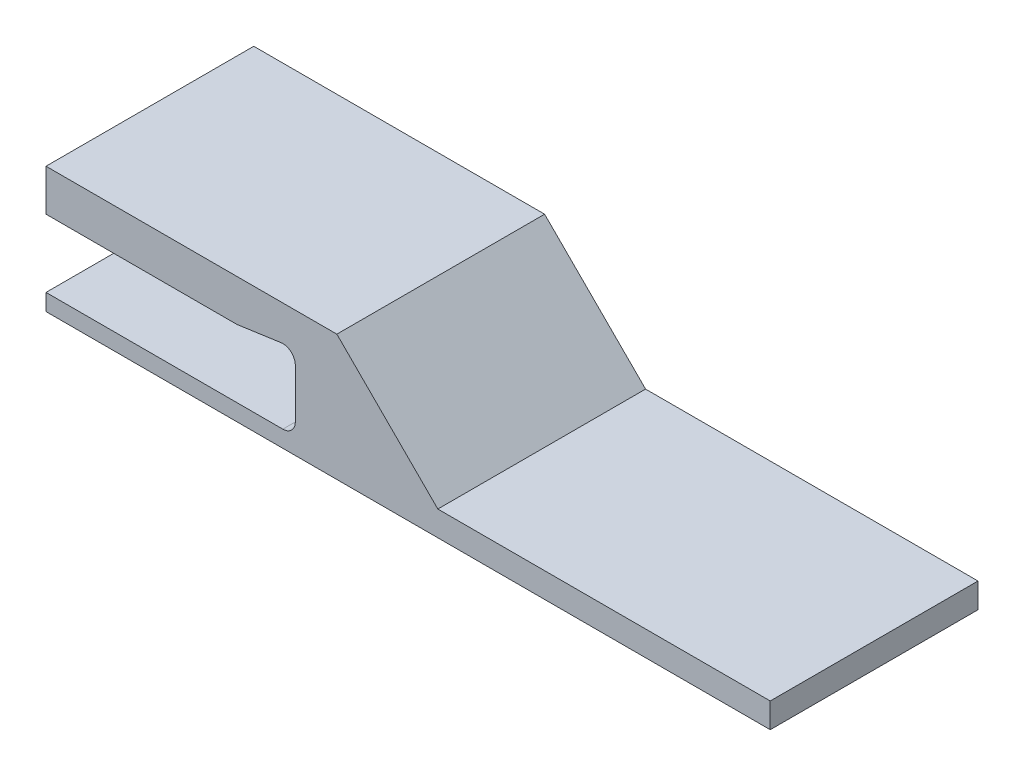
ISO-10303-21;
HEADER;
FILE_DESCRIPTION(('STEP AP214'),'2;1');
FILE_NAME('part.step','',(''),(''),'','','');
FILE_SCHEMA(('AUTOMOTIVE_DESIGN { 1 0 10303 214 1 1 1 1 }'));
ENDSEC;
DATA;
#1=APPLICATION_CONTEXT('core data for automotive mechanical design processes');
#2=APPLICATION_PROTOCOL_DEFINITION('international standard','automotive_design',2000,#1);
#3=PRODUCT_CONTEXT('',#1,'mechanical');
#4=PRODUCT('Part','Part','',(#3));
#5=PRODUCT_RELATED_PRODUCT_CATEGORY('part','',(#4));
#6=PRODUCT_DEFINITION_FORMATION('','',#4);
#7=PRODUCT_DEFINITION_CONTEXT('part definition',#1,'design');
#8=PRODUCT_DEFINITION('design','',#6,#7);
#9=PRODUCT_DEFINITION_SHAPE('','',#8);
#10=(LENGTH_UNIT() NAMED_UNIT(*) SI_UNIT(.MILLI.,.METRE.));
#11=(NAMED_UNIT(*) PLANE_ANGLE_UNIT() SI_UNIT($,.RADIAN.));
#12=(NAMED_UNIT(*) SI_UNIT($,.STERADIAN.) SOLID_ANGLE_UNIT());
#13=UNCERTAINTY_MEASURE_WITH_UNIT(LENGTH_MEASURE(1.E-05),#10,'distance_accuracy_value','');
#14=(GEOMETRIC_REPRESENTATION_CONTEXT(3) GLOBAL_UNCERTAINTY_ASSIGNED_CONTEXT((#13)) GLOBAL_UNIT_ASSIGNED_CONTEXT((#10,
#11,#12)) REPRESENTATION_CONTEXT('',''));
#15=CARTESIAN_POINT('',(0.,0.,0.));
#16=DIRECTION('',(0.,0.,1.));
#17=DIRECTION('',(1.,0.,0.));
#18=AXIS2_PLACEMENT_3D('',#15,#16,#17);
#19=CARTESIAN_POINT('',(174.3,0.,50.));
#20=DIRECTION('',(0.,1.,0.));
#21=DIRECTION('',(0.,0.,1.));
#22=AXIS2_PLACEMENT_3D('',#19,#20,#21);
#23=PLANE('',#22);
#24=DIRECTION('',(1.,0.,0.));
#25=VECTOR('',#24,1.);
#26=CARTESIAN_POINT('',(174.3,0.,0.));
#27=LINE('',#26,#25);
#28=CARTESIAN_POINT('',(0.,0.,0.));
#29=VERTEX_POINT('',#28);
#30=CARTESIAN_POINT('',(174.3,0.,0.));
#31=VERTEX_POINT('',#30);
#32=EDGE_CURVE('E171',#29,#31,#27,.T.);
#33=ORIENTED_EDGE('',*,*,#32,.T.);
#34=DIRECTION('',(0.,0.,-1.));
#35=VECTOR('',#34,1.);
#36=CARTESIAN_POINT('',(174.3,0.,50.));
#37=LINE('',#36,#35);
#38=CARTESIAN_POINT('',(174.3,0.,50.));
#39=VERTEX_POINT('',#38);
#40=EDGE_CURVE('E11',#39,#31,#37,.T.);
#41=ORIENTED_EDGE('',*,*,#40,.F.);
#42=DIRECTION('',(1.,0.,0.));
#43=VECTOR('',#42,1.);
#44=CARTESIAN_POINT('',(174.3,0.,50.));
#45=LINE('',#44,#43);
#46=CARTESIAN_POINT('',(0.,0.,50.));
#47=VERTEX_POINT('',#46);
#48=EDGE_CURVE('E197',#47,#39,#45,.T.);
#49=ORIENTED_EDGE('',*,*,#48,.F.);
#50=DIRECTION('',(0.,0.,-1.));
#51=VECTOR('',#50,1.);
#52=CARTESIAN_POINT('',(0.,0.,50.));
#53=LINE('',#52,#51);
#54=EDGE_CURVE('E167',#47,#29,#53,.T.);
#55=ORIENTED_EDGE('',*,*,#54,.T.);
#56=EDGE_LOOP('',(#33,#41,#49,#55));
#57=FACE_BOUND('',#56,.T.);
#58=ADVANCED_FACE('F39',(#57),#23,.F.);
#59=CARTESIAN_POINT('',(174.3,5.99999999999999,50.));
#60=DIRECTION('',(-1.,0.,0.));
#61=DIRECTION('',(0.,0.,1.));
#62=AXIS2_PLACEMENT_3D('',#59,#60,#61);
#63=PLANE('',#62);
#64=DIRECTION('',(0.,1.,0.));
#65=VECTOR('',#64,1.);
#66=CARTESIAN_POINT('',(174.3,5.99999999999999,0.));
#67=LINE('',#66,#65);
#68=CARTESIAN_POINT('',(174.3,5.99999999999999,0.));
#69=VERTEX_POINT('',#68);
#70=EDGE_CURVE('E174',#31,#69,#67,.T.);
#71=ORIENTED_EDGE('',*,*,#70,.T.);
#72=DIRECTION('',(0.,0.,-1.));
#73=VECTOR('',#72,1.);
#74=CARTESIAN_POINT('',(174.3,5.99999999999999,50.));
#75=LINE('',#74,#73);
#76=CARTESIAN_POINT('',(174.3,5.99999999999999,50.));
#77=VERTEX_POINT('',#76);
#78=EDGE_CURVE('E47',#77,#69,#75,.T.);
#79=ORIENTED_EDGE('',*,*,#78,.F.);
#80=DIRECTION('',(0.,1.,0.));
#81=VECTOR('',#80,1.);
#82=CARTESIAN_POINT('',(174.3,5.99999999999999,50.));
#83=LINE('',#82,#81);
#84=EDGE_CURVE('E116',#39,#77,#83,.T.);
#85=ORIENTED_EDGE('',*,*,#84,.F.);
#86=ORIENTED_EDGE('',*,*,#40,.T.);
#87=EDGE_LOOP('',(#71,#79,#85,#86));
#88=FACE_BOUND('',#87,.T.);
#89=ADVANCED_FACE('F285',(#88),#63,.F.);
#90=CARTESIAN_POINT('',(94.2999999999999,5.99999999999999,50.));
#91=DIRECTION('',(0.,-1.,0.));
#92=DIRECTION('',(1.,0.,0.));
#93=AXIS2_PLACEMENT_3D('',#90,#91,#92);
#94=PLANE('',#93);
#95=DIRECTION('',(-1.,0.,0.));
#96=VECTOR('',#95,1.);
#97=CARTESIAN_POINT('',(94.2999999999999,5.99999999999999,0.));
#98=LINE('',#97,#96);
#99=CARTESIAN_POINT('',(94.2999999999999,5.99999999999999,0.));
#100=VERTEX_POINT('',#99);
#101=EDGE_CURVE('E176',#69,#100,#98,.T.);
#102=ORIENTED_EDGE('',*,*,#101,.T.);
#103=DIRECTION('',(0.,0.,-1.));
#104=VECTOR('',#103,1.);
#105=CARTESIAN_POINT('',(94.2999999999999,5.99999999999999,50.));
#106=LINE('',#105,#104);
#107=CARTESIAN_POINT('',(94.2999999999999,5.99999999999999,50.));
#108=VERTEX_POINT('',#107);
#109=EDGE_CURVE('E222',#108,#100,#106,.T.);
#110=ORIENTED_EDGE('',*,*,#109,.F.);
#111=DIRECTION('',(-1.,0.,0.));
#112=VECTOR('',#111,1.);
#113=CARTESIAN_POINT('',(94.2999999999999,5.99999999999999,50.));
#114=LINE('',#113,#112);
#115=EDGE_CURVE('E230',#77,#108,#114,.T.);
#116=ORIENTED_EDGE('',*,*,#115,.F.);
#117=ORIENTED_EDGE('',*,*,#78,.T.);
#118=EDGE_LOOP('',(#102,#110,#116,#117));
#119=FACE_BOUND('',#118,.T.);
#120=ADVANCED_FACE('F228',(#119),#94,.F.);
#121=CARTESIAN_POINT('',(70.,30.3,50.));
#122=DIRECTION('',(-0.707106781186549,-0.707106781186546,0.));
#123=DIRECTION('',(0.707106781186546,-0.707106781186549,0.));
#124=AXIS2_PLACEMENT_3D('',#121,#122,#123);
#125=PLANE('',#124);
#126=DIRECTION('',(-0.707106781186546,0.707106781186549,0.));
#127=VECTOR('',#126,1.);
#128=CARTESIAN_POINT('',(70.,30.3,0.));
#129=LINE('',#128,#127);
#130=CARTESIAN_POINT('',(70.,30.3,0.));
#131=VERTEX_POINT('',#130);
#132=EDGE_CURVE('E178',#100,#131,#129,.T.);
#133=ORIENTED_EDGE('',*,*,#132,.T.);
#134=DIRECTION('',(0.,0.,-1.));
#135=VECTOR('',#134,1.);
#136=CARTESIAN_POINT('',(70.,30.3,50.));
#137=LINE('',#136,#135);
#138=CARTESIAN_POINT('',(70.,30.3,50.));
#139=VERTEX_POINT('',#138);
#140=EDGE_CURVE('E219',#139,#131,#137,.T.);
#141=ORIENTED_EDGE('',*,*,#140,.F.);
#142=DIRECTION('',(-0.707106781186546,0.707106781186549,0.));
#143=VECTOR('',#142,1.);
#144=CARTESIAN_POINT('',(70.,30.3,50.));
#145=LINE('',#144,#143);
#146=EDGE_CURVE('E248',#108,#139,#145,.T.);
#147=ORIENTED_EDGE('',*,*,#146,.F.);
#148=ORIENTED_EDGE('',*,*,#109,.T.);
#149=EDGE_LOOP('',(#133,#141,#147,#148));
#150=FACE_BOUND('',#149,.T.);
#151=ADVANCED_FACE('F239',(#150),#125,.F.);
#152=CARTESIAN_POINT('',(0.,30.3,50.));
#153=DIRECTION('',(0.,-1.,0.));
#154=DIRECTION('',(0.,0.,-1.));
#155=AXIS2_PLACEMENT_3D('',#152,#153,#154);
#156=PLANE('',#155);
#157=DIRECTION('',(-1.,0.,0.));
#158=VECTOR('',#157,1.);
#159=CARTESIAN_POINT('',(0.,30.3,0.));
#160=LINE('',#159,#158);
#161=CARTESIAN_POINT('',(0.,30.3,0.));
#162=VERTEX_POINT('',#161);
#163=EDGE_CURVE('E180',#131,#162,#160,.T.);
#164=ORIENTED_EDGE('',*,*,#163,.T.);
#165=DIRECTION('',(0.,0.,-1.));
#166=VECTOR('',#165,1.);
#167=CARTESIAN_POINT('',(0.,30.3,50.));
#168=LINE('',#167,#166);
#169=CARTESIAN_POINT('',(0.,30.3,50.));
#170=VERTEX_POINT('',#169);
#171=EDGE_CURVE('E216',#170,#162,#168,.T.);
#172=ORIENTED_EDGE('',*,*,#171,.F.);
#173=DIRECTION('',(-1.,0.,0.));
#174=VECTOR('',#173,1.);
#175=CARTESIAN_POINT('',(0.,30.3,50.));
#176=LINE('',#175,#174);
#177=EDGE_CURVE('E245',#139,#170,#176,.T.);
#178=ORIENTED_EDGE('',*,*,#177,.F.);
#179=ORIENTED_EDGE('',*,*,#140,.T.);
#180=EDGE_LOOP('',(#164,#172,#178,#179));
#181=FACE_BOUND('',#180,.T.);
#182=ADVANCED_FACE('F243',(#181),#156,.F.);
#183=CARTESIAN_POINT('',(0.,20.3,50.));
#184=DIRECTION('',(1.,0.,0.));
#185=DIRECTION('',(0.,0.,-1.));
#186=AXIS2_PLACEMENT_3D('',#183,#184,#185);
#187=PLANE('',#186);
#188=DIRECTION('',(0.,-1.,0.));
#189=VECTOR('',#188,1.);
#190=CARTESIAN_POINT('',(0.,20.3,0.));
#191=LINE('',#190,#189);
#192=CARTESIAN_POINT('',(0.,20.3,0.));
#193=VERTEX_POINT('',#192);
#194=EDGE_CURVE('E182',#162,#193,#191,.T.);
#195=ORIENTED_EDGE('',*,*,#194,.T.);
#196=DIRECTION('',(0.,0.,-1.));
#197=VECTOR('',#196,1.);
#198=CARTESIAN_POINT('',(0.,20.3,50.));
#199=LINE('',#198,#197);
#200=CARTESIAN_POINT('',(0.,20.3,50.));
#201=VERTEX_POINT('',#200);
#202=EDGE_CURVE('E213',#201,#193,#199,.T.);
#203=ORIENTED_EDGE('',*,*,#202,.F.);
#204=DIRECTION('',(0.,-1.,0.));
#205=VECTOR('',#204,1.);
#206=CARTESIAN_POINT('',(0.,20.3,50.));
#207=LINE('',#206,#205);
#208=EDGE_CURVE('E247',#170,#201,#207,.T.);
#209=ORIENTED_EDGE('',*,*,#208,.F.);
#210=ORIENTED_EDGE('',*,*,#171,.T.);
#211=EDGE_LOOP('',(#195,#203,#209,#210));
#212=FACE_BOUND('',#211,.T.);
#213=ADVANCED_FACE('F298',(#212),#187,.F.);
#214=CARTESIAN_POINT('',(45.7867965644036,20.3,50.));
#215=DIRECTION('',(0.,1.,0.));
#216=DIRECTION('',(-1.,0.,0.));
#217=AXIS2_PLACEMENT_3D('',#214,#215,#216);
#218=PLANE('',#217);
#219=DIRECTION('',(1.,0.,0.));
#220=VECTOR('',#219,1.);
#221=CARTESIAN_POINT('',(45.7867965644036,20.3,0.));
#222=LINE('',#221,#220);
#223=CARTESIAN_POINT('',(45.7867965644036,20.3,0.));
#224=VERTEX_POINT('',#223);
#225=EDGE_CURVE('E184',#193,#224,#222,.T.);
#226=ORIENTED_EDGE('',*,*,#225,.T.);
#227=DIRECTION('',(0.,0.,-1.));
#228=VECTOR('',#227,1.);
#229=CARTESIAN_POINT('',(45.7867965644036,20.3,50.));
#230=LINE('',#229,#228);
#231=CARTESIAN_POINT('',(45.7867965644036,20.3,50.));
#232=VERTEX_POINT('',#231);
#233=EDGE_CURVE('E210',#232,#224,#230,.T.);
#234=ORIENTED_EDGE('',*,*,#233,.F.);
#235=DIRECTION('',(1.,0.,0.));
#236=VECTOR('',#235,1.);
#237=CARTESIAN_POINT('',(45.7867965644036,20.3,50.));
#238=LINE('',#237,#236);
#239=EDGE_CURVE('E250',#201,#232,#238,.T.);
#240=ORIENTED_EDGE('',*,*,#239,.F.);
#241=ORIENTED_EDGE('',*,*,#202,.T.);
#242=EDGE_LOOP('',(#226,#234,#240,#241));
#243=FACE_BOUND('',#242,.T.);
#244=ADVANCED_FACE('F301',(#243),#218,.F.);
#245=CARTESIAN_POINT('',(45.7867965644036,23.3,50.));
#246=DIRECTION('',(0.,0.,-1.));
#247=DIRECTION('',(-1.,0.,0.));
#248=AXIS2_PLACEMENT_3D('',#245,#246,#247);
#249=CYLINDRICAL_SURFACE('',#248,3.);
#250=CARTESIAN_POINT('',(45.7867965644036,23.3,0.));
#251=DIRECTION('',(0.,0.,1.));
#252=DIRECTION('',(-1.,0.,0.));
#253=AXIS2_PLACEMENT_3D('',#250,#251,#252);
#254=CIRCLE('',#253,3.);
#255=CARTESIAN_POINT('',(46.2110606331155,20.3301515190165,0.));
#256=VERTEX_POINT('',#255);
#257=EDGE_CURVE('E186',#224,#256,#254,.T.);
#258=ORIENTED_EDGE('',*,*,#257,.T.);
#259=DIRECTION('',(0.,0.,-1.));
#260=VECTOR('',#259,1.);
#261=CARTESIAN_POINT('',(46.2110606331155,20.3301515190165,50.));
#262=LINE('',#261,#260);
#263=CARTESIAN_POINT('',(46.2110606331155,20.3301515190165,50.));
#264=VERTEX_POINT('',#263);
#265=EDGE_CURVE('E207',#264,#256,#262,.T.);
#266=ORIENTED_EDGE('',*,*,#265,.F.);
#267=CARTESIAN_POINT('',(45.7867965644036,23.3,50.));
#268=DIRECTION('',(0.,0.,1.));
#269=DIRECTION('',(-1.,0.,0.));
#270=AXIS2_PLACEMENT_3D('',#267,#268,#269);
#271=CIRCLE('',#270,3.);
#272=EDGE_CURVE('E256',#232,#264,#271,.T.);
#273=ORIENTED_EDGE('',*,*,#272,.F.);
#274=ORIENTED_EDGE('',*,*,#233,.T.);
#275=EDGE_LOOP('',(#258,#266,#273,#274));
#276=FACE_BOUND('',#275,.T.);
#277=ADVANCED_FACE('F305',(#276),#249,.T.);
#278=CARTESIAN_POINT('',(56.5757359312881,21.8108194187554,50.));
#279=DIRECTION('',(-0.141421356237309,0.989949493661167,0.));
#280=DIRECTION('',(-0.989949493661167,-0.141421356237309,0.));
#281=AXIS2_PLACEMENT_3D('',#278,#279,#280);
#282=PLANE('',#281);
#283=DIRECTION('',(0.989949493661167,0.141421356237309,0.));
#284=VECTOR('',#283,1.);
#285=CARTESIAN_POINT('',(56.5757359312881,21.8108194187554,0.));
#286=LINE('',#285,#284);
#287=CARTESIAN_POINT('',(56.5757359312881,21.8108194187554,0.));
#288=VERTEX_POINT('',#287);
#289=EDGE_CURVE('E188',#256,#288,#286,.T.);
#290=ORIENTED_EDGE('',*,*,#289,.T.);
#291=DIRECTION('',(0.,0.,-1.));
#292=VECTOR('',#291,1.);
#293=CARTESIAN_POINT('',(56.5757359312881,21.8108194187554,50.));
#294=LINE('',#293,#292);
#295=CARTESIAN_POINT('',(56.5757359312881,21.8108194187554,50.));
#296=VERTEX_POINT('',#295);
#297=EDGE_CURVE('E204',#296,#288,#294,.T.);
#298=ORIENTED_EDGE('',*,*,#297,.F.);
#299=DIRECTION('',(0.989949493661167,0.141421356237309,0.));
#300=VECTOR('',#299,1.);
#301=CARTESIAN_POINT('',(56.5757359312881,21.8108194187554,50.));
#302=LINE('',#301,#300);
#303=EDGE_CURVE('E258',#264,#296,#302,.T.);
#304=ORIENTED_EDGE('',*,*,#303,.F.);
#305=ORIENTED_EDGE('',*,*,#265,.T.);
#306=EDGE_LOOP('',(#290,#298,#304,#305));
#307=FACE_BOUND('',#306,.T.);
#308=ADVANCED_FACE('F309',(#307),#282,.F.);
#309=CARTESIAN_POINT('',(57.,18.8409709377719,50.));
#310=DIRECTION('',(0.,0.,-1.));
#311=DIRECTION('',(-1.,0.,0.));
#312=AXIS2_PLACEMENT_3D('',#309,#310,#311);
#313=CYLINDRICAL_SURFACE('',#312,3.);
#314=CARTESIAN_POINT('',(57.,18.8409709377719,0.));
#315=DIRECTION('',(0.,0.,-1.));
#316=DIRECTION('',(1.,0.,0.));
#317=AXIS2_PLACEMENT_3D('',#314,#315,#316);
#318=CIRCLE('',#317,3.);
#319=CARTESIAN_POINT('',(60.,18.8409709377719,0.));
#320=VERTEX_POINT('',#319);
#321=EDGE_CURVE('E190',#288,#320,#318,.T.);
#322=ORIENTED_EDGE('',*,*,#321,.T.);
#323=DIRECTION('',(0.,0.,-1.));
#324=VECTOR('',#323,1.);
#325=CARTESIAN_POINT('',(60.,18.8409709377719,50.));
#326=LINE('',#325,#324);
#327=CARTESIAN_POINT('',(60.,18.8409709377719,50.));
#328=VERTEX_POINT('',#327);
#329=EDGE_CURVE('E201',#328,#320,#326,.T.);
#330=ORIENTED_EDGE('',*,*,#329,.F.);
#331=CARTESIAN_POINT('',(57.,18.8409709377719,50.));
#332=DIRECTION('',(0.,0.,-1.));
#333=DIRECTION('',(1.,0.,0.));
#334=AXIS2_PLACEMENT_3D('',#331,#332,#333);
#335=CIRCLE('',#334,3.);
#336=EDGE_CURVE('E260',#296,#328,#335,.T.);
#337=ORIENTED_EDGE('',*,*,#336,.F.);
#338=ORIENTED_EDGE('',*,*,#297,.T.);
#339=EDGE_LOOP('',(#322,#330,#337,#338));
#340=FACE_BOUND('',#339,.T.);
#341=ADVANCED_FACE('F266',(#340),#313,.F.);
#342=CARTESIAN_POINT('',(60.,6.99999999999998,50.));
#343=DIRECTION('',(1.,0.,0.));
#344=DIRECTION('',(0.,0.,-1.));
#345=AXIS2_PLACEMENT_3D('',#342,#343,#344);
#346=PLANE('',#345);
#347=DIRECTION('',(0.,-1.,0.));
#348=VECTOR('',#347,1.);
#349=CARTESIAN_POINT('',(60.,6.99999999999998,0.));
#350=LINE('',#349,#348);
#351=CARTESIAN_POINT('',(60.,6.99999999999998,0.));
#352=VERTEX_POINT('',#351);
#353=EDGE_CURVE('E192',#320,#352,#350,.T.);
#354=ORIENTED_EDGE('',*,*,#353,.T.);
#355=DIRECTION('',(0.,0.,-1.));
#356=VECTOR('',#355,1.);
#357=CARTESIAN_POINT('',(60.,6.99999999999998,50.));
#358=LINE('',#357,#356);
#359=CARTESIAN_POINT('',(60.,6.99999999999998,50.));
#360=VERTEX_POINT('',#359);
#361=EDGE_CURVE('E162',#360,#352,#358,.T.);
#362=ORIENTED_EDGE('',*,*,#361,.F.);
#363=DIRECTION('',(0.,-1.,0.));
#364=VECTOR('',#363,1.);
#365=CARTESIAN_POINT('',(60.,6.99999999999998,50.));
#366=LINE('',#365,#364);
#367=EDGE_CURVE('E153',#328,#360,#366,.T.);
#368=ORIENTED_EDGE('',*,*,#367,.F.);
#369=ORIENTED_EDGE('',*,*,#329,.T.);
#370=EDGE_LOOP('',(#354,#362,#368,#369));
#371=FACE_BOUND('',#370,.T.);
#372=ADVANCED_FACE('F270',(#371),#346,.F.);
#373=CARTESIAN_POINT('',(57.,6.99999999999998,50.));
#374=DIRECTION('',(0.,0.,-1.));
#375=DIRECTION('',(-1.,0.,0.));
#376=AXIS2_PLACEMENT_3D('',#373,#374,#375);
#377=CYLINDRICAL_SURFACE('',#376,3.);
#378=CARTESIAN_POINT('',(57.,6.99999999999998,0.));
#379=DIRECTION('',(0.,0.,-1.));
#380=DIRECTION('',(1.,0.,0.));
#381=AXIS2_PLACEMENT_3D('',#378,#379,#380);
#382=CIRCLE('',#381,3.);
#383=CARTESIAN_POINT('',(57.,3.99999999999998,0.));
#384=VERTEX_POINT('',#383);
#385=EDGE_CURVE('E161',#352,#384,#382,.T.);
#386=ORIENTED_EDGE('',*,*,#385,.T.);
#387=DIRECTION('',(0.,0.,-1.));
#388=VECTOR('',#387,1.);
#389=CARTESIAN_POINT('',(57.,3.99999999999998,50.));
#390=LINE('',#389,#388);
#391=CARTESIAN_POINT('',(57.,3.99999999999998,50.));
#392=VERTEX_POINT('',#391);
#393=EDGE_CURVE('E158',#392,#384,#390,.T.);
#394=ORIENTED_EDGE('',*,*,#393,.F.);
#395=CARTESIAN_POINT('',(57.,6.99999999999998,50.));
#396=DIRECTION('',(0.,0.,-1.));
#397=DIRECTION('',(1.,0.,0.));
#398=AXIS2_PLACEMENT_3D('',#395,#396,#397);
#399=CIRCLE('',#398,3.);
#400=EDGE_CURVE('E147',#360,#392,#399,.T.);
#401=ORIENTED_EDGE('',*,*,#400,.F.);
#402=ORIENTED_EDGE('',*,*,#361,.T.);
#403=EDGE_LOOP('',(#386,#394,#401,#402));
#404=FACE_BOUND('',#403,.T.);
#405=ADVANCED_FACE('F159',(#404),#377,.F.);
#406=CARTESIAN_POINT('',(0.,3.99999999999998,50.));
#407=DIRECTION('',(0.,-1.,0.));
#408=DIRECTION('',(0.,0.,-1.));
#409=AXIS2_PLACEMENT_3D('',#406,#407,#408);
#410=PLANE('',#409);
#411=DIRECTION('',(-1.,0.,0.));
#412=VECTOR('',#411,1.);
#413=CARTESIAN_POINT('',(0.,3.99999999999998,0.));
#414=LINE('',#413,#412);
#415=CARTESIAN_POINT('',(0.,3.99999999999998,0.));
#416=VERTEX_POINT('',#415);
#417=EDGE_CURVE('E102',#384,#416,#414,.T.);
#418=ORIENTED_EDGE('',*,*,#417,.T.);
#419=DIRECTION('',(0.,0.,-1.));
#420=VECTOR('',#419,1.);
#421=CARTESIAN_POINT('',(0.,3.99999999999998,50.));
#422=LINE('',#421,#420);
#423=CARTESIAN_POINT('',(0.,3.99999999999998,50.));
#424=VERTEX_POINT('',#423);
#425=EDGE_CURVE('E163',#424,#416,#422,.T.);
#426=ORIENTED_EDGE('',*,*,#425,.F.);
#427=DIRECTION('',(-1.,0.,0.));
#428=VECTOR('',#427,1.);
#429=CARTESIAN_POINT('',(0.,3.99999999999998,50.));
#430=LINE('',#429,#428);
#431=EDGE_CURVE('E151',#392,#424,#430,.T.);
#432=ORIENTED_EDGE('',*,*,#431,.F.);
#433=ORIENTED_EDGE('',*,*,#393,.T.);
#434=EDGE_LOOP('',(#418,#426,#432,#433));
#435=FACE_BOUND('',#434,.T.);
#436=ADVANCED_FACE('F165',(#435),#410,.F.);
#437=CARTESIAN_POINT('',(0.,0.,50.));
#438=DIRECTION('',(1.,0.,0.));
#439=DIRECTION('',(0.,0.,-1.));
#440=AXIS2_PLACEMENT_3D('',#437,#438,#439);
#441=PLANE('',#440);
#442=DIRECTION('',(0.,-1.,0.));
#443=VECTOR('',#442,1.);
#444=CARTESIAN_POINT('',(0.,0.,0.));
#445=LINE('',#444,#443);
#446=EDGE_CURVE('E108',#416,#29,#445,.T.);
#447=ORIENTED_EDGE('',*,*,#446,.T.);
#448=ORIENTED_EDGE('',*,*,#54,.F.);
#449=DIRECTION('',(0.,-1.,0.));
#450=VECTOR('',#449,1.);
#451=CARTESIAN_POINT('',(0.,0.,50.));
#452=LINE('',#451,#450);
#453=EDGE_CURVE('E55',#424,#47,#452,.T.);
#454=ORIENTED_EDGE('',*,*,#453,.F.);
#455=ORIENTED_EDGE('',*,*,#425,.T.);
#456=EDGE_LOOP('',(#447,#448,#454,#455));
#457=FACE_BOUND('',#456,.T.);
#458=ADVANCED_FACE('F274',(#457),#441,.F.);
#459=CARTESIAN_POINT('',(57.,6.99999999999998,50.));
#460=DIRECTION('',(0.,0.,1.));
#461=DIRECTION('',(1.,0.,0.));
#462=AXIS2_PLACEMENT_3D('',#459,#460,#461);
#463=PLANE('',#462);
#464=ORIENTED_EDGE('',*,*,#48,.T.);
#465=ORIENTED_EDGE('',*,*,#84,.T.);
#466=ORIENTED_EDGE('',*,*,#115,.T.);
#467=ORIENTED_EDGE('',*,*,#146,.T.);
#468=ORIENTED_EDGE('',*,*,#177,.T.);
#469=ORIENTED_EDGE('',*,*,#208,.T.);
#470=ORIENTED_EDGE('',*,*,#239,.T.);
#471=ORIENTED_EDGE('',*,*,#272,.T.);
#472=ORIENTED_EDGE('',*,*,#303,.T.);
#473=ORIENTED_EDGE('',*,*,#336,.T.);
#474=ORIENTED_EDGE('',*,*,#367,.T.);
#475=ORIENTED_EDGE('',*,*,#400,.T.);
#476=ORIENTED_EDGE('',*,*,#431,.T.);
#477=ORIENTED_EDGE('',*,*,#453,.T.);
#478=EDGE_LOOP('',(#464,#465,#466,#467,#468,#469,#470,#471,#472,#473,#474,#475,#476,#477));
#479=FACE_BOUND('',#478,.T.);
#480=ADVANCED_FACE('F149',(#479),#463,.T.);
#481=CARTESIAN_POINT('',(57.,6.99999999999998,0.));
#482=DIRECTION('',(0.,0.,1.));
#483=DIRECTION('',(1.,0.,0.));
#484=AXIS2_PLACEMENT_3D('',#481,#482,#483);
#485=PLANE('',#484);
#486=ORIENTED_EDGE('',*,*,#32,.F.);
#487=ORIENTED_EDGE('',*,*,#446,.F.);
#488=ORIENTED_EDGE('',*,*,#417,.F.);
#489=ORIENTED_EDGE('',*,*,#385,.F.);
#490=ORIENTED_EDGE('',*,*,#353,.F.);
#491=ORIENTED_EDGE('',*,*,#321,.F.);
#492=ORIENTED_EDGE('',*,*,#289,.F.);
#493=ORIENTED_EDGE('',*,*,#257,.F.);
#494=ORIENTED_EDGE('',*,*,#225,.F.);
#495=ORIENTED_EDGE('',*,*,#194,.F.);
#496=ORIENTED_EDGE('',*,*,#163,.F.);
#497=ORIENTED_EDGE('',*,*,#132,.F.);
#498=ORIENTED_EDGE('',*,*,#101,.F.);
#499=ORIENTED_EDGE('',*,*,#70,.F.);
#500=EDGE_LOOP('',(#486,#487,#488,#489,#490,#491,#492,#493,#494,#495,#496,#497,#498,#499));
#501=FACE_BOUND('',#500,.T.);
#502=ADVANCED_FACE('F234',(#501),#485,.F.);
#503=CLOSED_SHELL('',(#58,#89,#120,#151,#182,#213,#244,#277,#308,#341,#372,#405,#436,#458,#480,#502));
#504=MANIFOLD_SOLID_BREP('B2',#503);
#505=ADVANCED_BREP_SHAPE_REPRESENTATION('',(#18,#504),#14);
#506=SHAPE_DEFINITION_REPRESENTATION(#9,#505);
ENDSEC;
END-ISO-10303-21;
